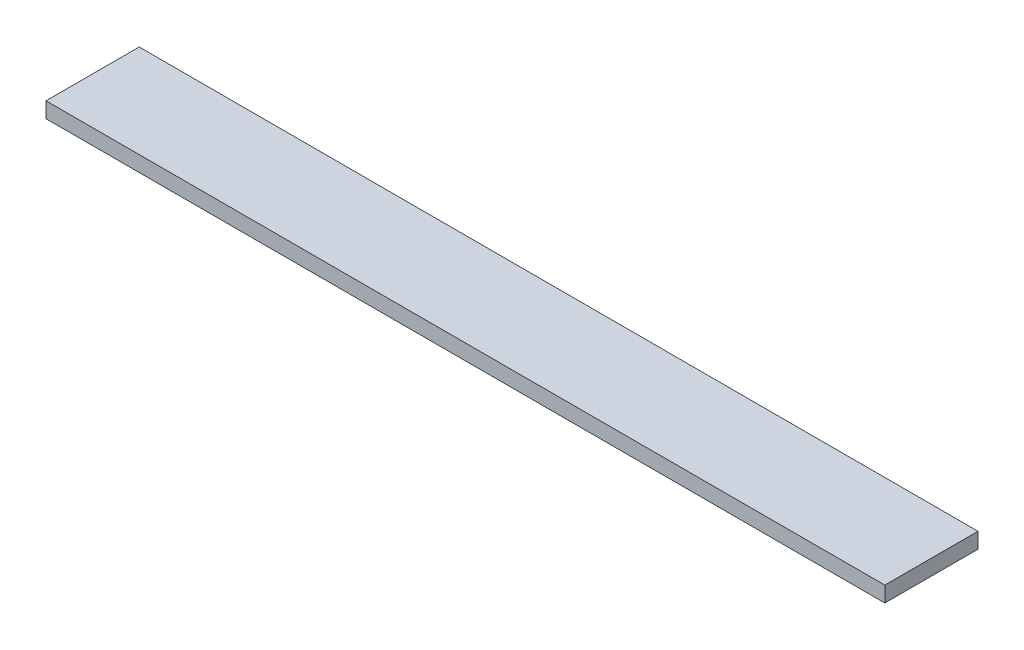
ISO-10303-21;
HEADER;
FILE_DESCRIPTION(('STEP AP214'),'2;1');
FILE_NAME('part.step','',(''),(''),'','','');
FILE_SCHEMA(('AUTOMOTIVE_DESIGN { 1 0 10303 214 1 1 1 1 }'));
ENDSEC;
DATA;
#1=APPLICATION_CONTEXT('core data for automotive mechanical design processes');
#2=APPLICATION_PROTOCOL_DEFINITION('international standard','automotive_design',2000,#1);
#3=PRODUCT_CONTEXT('',#1,'mechanical');
#4=PRODUCT('Part','Part','',(#3));
#5=PRODUCT_RELATED_PRODUCT_CATEGORY('part','',(#4));
#6=PRODUCT_DEFINITION_FORMATION('','',#4);
#7=PRODUCT_DEFINITION_CONTEXT('part definition',#1,'design');
#8=PRODUCT_DEFINITION('design','',#6,#7);
#9=PRODUCT_DEFINITION_SHAPE('','',#8);
#10=(LENGTH_UNIT() NAMED_UNIT(*) SI_UNIT(.MILLI.,.METRE.));
#11=(NAMED_UNIT(*) PLANE_ANGLE_UNIT() SI_UNIT($,.RADIAN.));
#12=(NAMED_UNIT(*) SI_UNIT($,.STERADIAN.) SOLID_ANGLE_UNIT());
#13=UNCERTAINTY_MEASURE_WITH_UNIT(LENGTH_MEASURE(1.E-05),#10,'distance_accuracy_value','');
#14=(GEOMETRIC_REPRESENTATION_CONTEXT(3) GLOBAL_UNCERTAINTY_ASSIGNED_CONTEXT((#13)) GLOBAL_UNIT_ASSIGNED_CONTEXT((#10,
#11,#12)) REPRESENTATION_CONTEXT('',''));
#15=CARTESIAN_POINT('',(0.,0.,0.));
#16=DIRECTION('',(0.,0.,1.));
#17=DIRECTION('',(1.,0.,0.));
#18=AXIS2_PLACEMENT_3D('',#15,#16,#17);
#19=CARTESIAN_POINT('',(-685.8,12.7,76.2));
#20=DIRECTION('',(1.,0.,0.));
#21=DIRECTION('',(0.,0.,-1.));
#22=AXIS2_PLACEMENT_3D('',#19,#20,#21);
#23=PLANE('',#22);
#24=DIRECTION('',(0.,0.,1.));
#25=VECTOR('',#24,1.);
#26=CARTESIAN_POINT('',(-685.8,0.,76.2));
#27=LINE('',#26,#25);
#28=CARTESIAN_POINT('',(-685.8,0.,0.));
#29=VERTEX_POINT('',#28);
#30=CARTESIAN_POINT('',(-685.8,0.,76.2));
#31=VERTEX_POINT('',#30);
#32=EDGE_CURVE('E98',#29,#31,#27,.T.);
#33=ORIENTED_EDGE('',*,*,#32,.T.);
#34=DIRECTION('',(0.,-1.,0.));
#35=VECTOR('',#34,1.);
#36=CARTESIAN_POINT('',(-685.8,12.7,76.2));
#37=LINE('',#36,#35);
#38=CARTESIAN_POINT('',(-685.8,12.7,76.2));
#39=VERTEX_POINT('',#38);
#40=EDGE_CURVE('E11',#39,#31,#37,.T.);
#41=ORIENTED_EDGE('',*,*,#40,.F.);
#42=DIRECTION('',(0.,0.,1.));
#43=VECTOR('',#42,1.);
#44=CARTESIAN_POINT('',(-685.8,12.7,76.2));
#45=LINE('',#44,#43);
#46=CARTESIAN_POINT('',(-685.8,12.7,0.));
#47=VERTEX_POINT('',#46);
#48=EDGE_CURVE('E86',#47,#39,#45,.T.);
#49=ORIENTED_EDGE('',*,*,#48,.F.);
#50=DIRECTION('',(0.,-1.,0.));
#51=VECTOR('',#50,1.);
#52=CARTESIAN_POINT('',(-685.8,12.7,0.));
#53=LINE('',#52,#51);
#54=EDGE_CURVE('E94',#47,#29,#53,.T.);
#55=ORIENTED_EDGE('',*,*,#54,.T.);
#56=EDGE_LOOP('',(#33,#41,#49,#55));
#57=FACE_BOUND('',#56,.T.);
#58=ADVANCED_FACE('F35',(#57),#23,.F.);
#59=CARTESIAN_POINT('',(-685.8,12.7,76.2));
#60=DIRECTION('',(0.,0.,-1.));
#61=DIRECTION('',(-1.,0.,0.));
#62=AXIS2_PLACEMENT_3D('',#59,#60,#61);
#63=PLANE('',#62);
#64=DIRECTION('',(1.,0.,0.));
#65=VECTOR('',#64,1.);
#66=CARTESIAN_POINT('',(-685.8,0.,76.2));
#67=LINE('',#66,#65);
#68=CARTESIAN_POINT('',(0.,0.,76.2));
#69=VERTEX_POINT('',#68);
#70=EDGE_CURVE('E90',#31,#69,#67,.T.);
#71=ORIENTED_EDGE('',*,*,#70,.T.);
#72=DIRECTION('',(0.,-1.,0.));
#73=VECTOR('',#72,1.);
#74=CARTESIAN_POINT('',(0.,12.7,76.2));
#75=LINE('',#74,#73);
#76=CARTESIAN_POINT('',(0.,12.7,76.2));
#77=VERTEX_POINT('',#76);
#78=EDGE_CURVE('E43',#77,#69,#75,.T.);
#79=ORIENTED_EDGE('',*,*,#78,.F.);
#80=DIRECTION('',(1.,0.,0.));
#81=VECTOR('',#80,1.);
#82=CARTESIAN_POINT('',(-685.8,12.7,76.2));
#83=LINE('',#82,#81);
#84=EDGE_CURVE('E81',#39,#77,#83,.T.);
#85=ORIENTED_EDGE('',*,*,#84,.F.);
#86=ORIENTED_EDGE('',*,*,#40,.T.);
#87=EDGE_LOOP('',(#71,#79,#85,#86));
#88=FACE_BOUND('',#87,.T.);
#89=ADVANCED_FACE('F89',(#88),#63,.F.);
#90=CARTESIAN_POINT('',(0.,12.7,76.2));
#91=DIRECTION('',(-1.,0.,0.));
#92=DIRECTION('',(0.,0.,1.));
#93=AXIS2_PLACEMENT_3D('',#90,#91,#92);
#94=PLANE('',#93);
#95=DIRECTION('',(0.,0.,-1.));
#96=VECTOR('',#95,1.);
#97=CARTESIAN_POINT('',(0.,0.,76.2));
#98=LINE('',#97,#96);
#99=CARTESIAN_POINT('',(0.,0.,0.));
#100=VERTEX_POINT('',#99);
#101=EDGE_CURVE('E68',#69,#100,#98,.T.);
#102=ORIENTED_EDGE('',*,*,#101,.T.);
#103=DIRECTION('',(0.,-1.,0.));
#104=VECTOR('',#103,1.);
#105=CARTESIAN_POINT('',(0.,12.7,0.));
#106=LINE('',#105,#104);
#107=CARTESIAN_POINT('',(0.,12.7,0.));
#108=VERTEX_POINT('',#107);
#109=EDGE_CURVE('E91',#108,#100,#106,.T.);
#110=ORIENTED_EDGE('',*,*,#109,.F.);
#111=DIRECTION('',(0.,0.,-1.));
#112=VECTOR('',#111,1.);
#113=CARTESIAN_POINT('',(0.,12.7,76.2));
#114=LINE('',#113,#112);
#115=EDGE_CURVE('E84',#77,#108,#114,.T.);
#116=ORIENTED_EDGE('',*,*,#115,.F.);
#117=ORIENTED_EDGE('',*,*,#78,.T.);
#118=EDGE_LOOP('',(#102,#110,#116,#117));
#119=FACE_BOUND('',#118,.T.);
#120=ADVANCED_FACE('F92',(#119),#94,.F.);
#121=CARTESIAN_POINT('',(-685.8,12.7,0.));
#122=DIRECTION('',(0.,0.,1.));
#123=DIRECTION('',(1.,0.,0.));
#124=AXIS2_PLACEMENT_3D('',#121,#122,#123);
#125=PLANE('',#124);
#126=DIRECTION('',(-1.,0.,0.));
#127=VECTOR('',#126,1.);
#128=CARTESIAN_POINT('',(-685.8,0.,0.));
#129=LINE('',#128,#127);
#130=EDGE_CURVE('E74',#100,#29,#129,.T.);
#131=ORIENTED_EDGE('',*,*,#130,.T.);
#132=ORIENTED_EDGE('',*,*,#54,.F.);
#133=DIRECTION('',(-1.,0.,0.));
#134=VECTOR('',#133,1.);
#135=CARTESIAN_POINT('',(-685.8,12.7,0.));
#136=LINE('',#135,#134);
#137=EDGE_CURVE('E51',#108,#47,#136,.T.);
#138=ORIENTED_EDGE('',*,*,#137,.F.);
#139=ORIENTED_EDGE('',*,*,#109,.T.);
#140=EDGE_LOOP('',(#131,#132,#138,#139));
#141=FACE_BOUND('',#140,.T.);
#142=ADVANCED_FACE('F105',(#141),#125,.F.);
#143=CARTESIAN_POINT('',(0.,12.7,0.));
#144=DIRECTION('',(0.,-1.,0.));
#145=DIRECTION('',(0.,0.,-1.));
#146=AXIS2_PLACEMENT_3D('',#143,#144,#145);
#147=PLANE('',#146);
#148=ORIENTED_EDGE('',*,*,#48,.T.);
#149=ORIENTED_EDGE('',*,*,#84,.T.);
#150=ORIENTED_EDGE('',*,*,#115,.T.);
#151=ORIENTED_EDGE('',*,*,#137,.T.);
#152=EDGE_LOOP('',(#148,#149,#150,#151));
#153=FACE_BOUND('',#152,.T.);
#154=ADVANCED_FACE('F82',(#153),#147,.F.);
#155=CARTESIAN_POINT('',(0.,0.,0.));
#156=DIRECTION('',(0.,-1.,0.));
#157=DIRECTION('',(0.,0.,-1.));
#158=AXIS2_PLACEMENT_3D('',#155,#156,#157);
#159=PLANE('',#158);
#160=ORIENTED_EDGE('',*,*,#32,.F.);
#161=ORIENTED_EDGE('',*,*,#130,.F.);
#162=ORIENTED_EDGE('',*,*,#101,.F.);
#163=ORIENTED_EDGE('',*,*,#70,.F.);
#164=EDGE_LOOP('',(#160,#161,#162,#163));
#165=FACE_BOUND('',#164,.T.);
#166=ADVANCED_FACE('F108',(#165),#159,.T.);
#167=CLOSED_SHELL('',(#58,#89,#120,#142,#154,#166));
#168=MANIFOLD_SOLID_BREP('B2',#167);
#169=ADVANCED_BREP_SHAPE_REPRESENTATION('',(#18,#168),#14);
#170=SHAPE_DEFINITION_REPRESENTATION(#9,#169);
ENDSEC;
END-ISO-10303-21;
